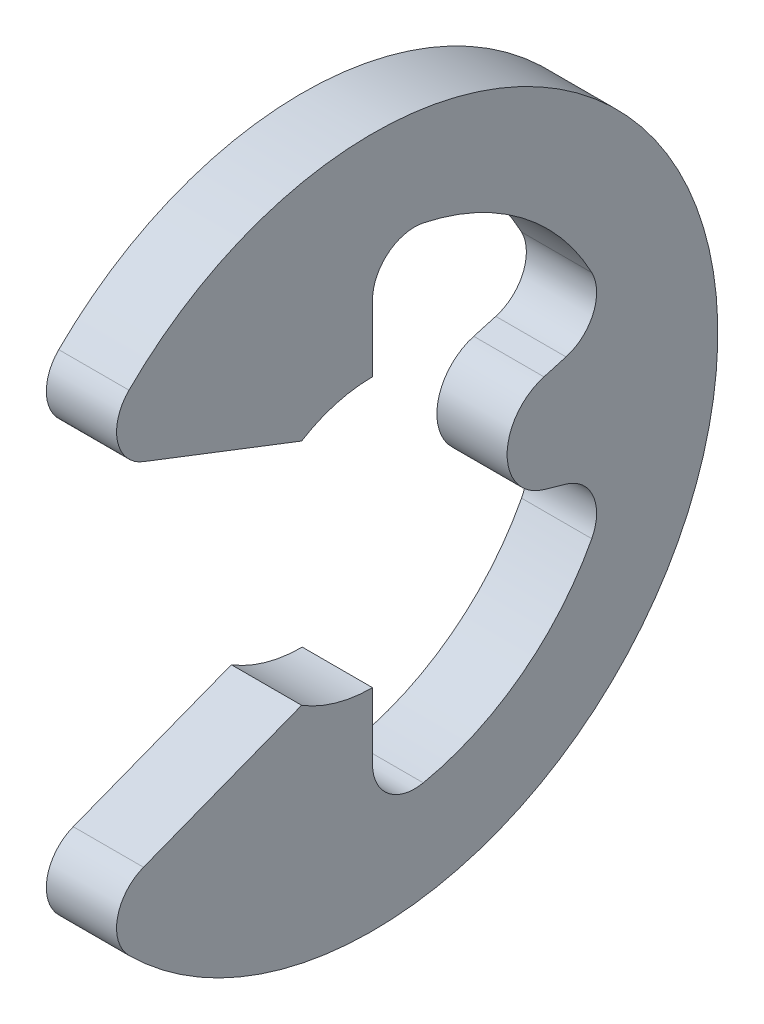
ISO-10303-21;
HEADER;
FILE_DESCRIPTION(('STEP AP214'),'2;1');
FILE_NAME('part.step','',(''),(''),'','','');
FILE_SCHEMA(('AUTOMOTIVE_DESIGN { 1 0 10303 214 1 1 1 1 }'));
ENDSEC;
DATA;
#1=APPLICATION_CONTEXT('core data for automotive mechanical design processes');
#2=APPLICATION_PROTOCOL_DEFINITION('international standard','automotive_design',2000,#1);
#3=PRODUCT_CONTEXT('',#1,'mechanical');
#4=PRODUCT('Part','Part','',(#3));
#5=PRODUCT_RELATED_PRODUCT_CATEGORY('part','',(#4));
#6=PRODUCT_DEFINITION_FORMATION('','',#4);
#7=PRODUCT_DEFINITION_CONTEXT('part definition',#1,'design');
#8=PRODUCT_DEFINITION('design','',#6,#7);
#9=PRODUCT_DEFINITION_SHAPE('','',#8);
#10=(LENGTH_UNIT() NAMED_UNIT(*) SI_UNIT(.MILLI.,.METRE.));
#11=(NAMED_UNIT(*) PLANE_ANGLE_UNIT() SI_UNIT($,.RADIAN.));
#12=(NAMED_UNIT(*) SI_UNIT($,.STERADIAN.) SOLID_ANGLE_UNIT());
#13=UNCERTAINTY_MEASURE_WITH_UNIT(LENGTH_MEASURE(1.E-05),#10,'distance_accuracy_value','');
#14=(GEOMETRIC_REPRESENTATION_CONTEXT(3) GLOBAL_UNCERTAINTY_ASSIGNED_CONTEXT((#13)) GLOBAL_UNIT_ASSIGNED_CONTEXT((#10,
#11,#12)) REPRESENTATION_CONTEXT('',''));
#15=CARTESIAN_POINT('',(0.,0.,0.));
#16=DIRECTION('',(0.,0.,1.));
#17=DIRECTION('',(1.,0.,0.));
#18=AXIS2_PLACEMENT_3D('',#15,#16,#17);
#19=CARTESIAN_POINT('',(0.3,0.,0.));
#20=DIRECTION('',(1.,0.,0.));
#21=DIRECTION('',(0.,0.,-1.));
#22=AXIS2_PLACEMENT_3D('',#19,#20,#21);
#23=PLANE('',#22);
#24=CARTESIAN_POINT('',(0.3,0.,-1.58371942763835));
#25=DIRECTION('',(1.,0.,0.));
#26=DIRECTION('',(0.,0.,-1.));
#27=AXIS2_PLACEMENT_3D('',#24,#25,#26);
#28=CIRCLE('',#27,0.433719427638346);
#29=CARTESIAN_POINT('',(0.3,0.417137988281592,-1.46494047056547));
#30=VERTEX_POINT('',#29);
#31=CARTESIAN_POINT('',(0.3,-0.417137988281593,-1.46494047056547));
#32=VERTEX_POINT('',#31);
#33=EDGE_CURVE('E192',#30,#32,#28,.T.);
#34=ORIENTED_EDGE('',*,*,#33,.T.);
#35=DIRECTION('',(0.,-0.273861278752584,-0.961769203083567));
#36=VECTOR('',#35,1.);
#37=CARTESIAN_POINT('',(0.3,-0.31494047056547,-1.1060345835461));
#38=LINE('',#37,#36);
#39=CARTESIAN_POINT('',(0.3,-0.470721986256722,-1.65312128701864));
#40=VERTEX_POINT('',#39);
#41=EDGE_CURVE('E93',#32,#40,#38,.T.);
#42=ORIENTED_EDGE('',*,*,#41,.T.);
#43=CARTESIAN_POINT('',(0.3,-0.816958899366806,-1.55453122666771));
#44=DIRECTION('',(1.,0.,0.));
#45=DIRECTION('',(0.,0.,-1.));
#46=AXIS2_PLACEMENT_3D('',#43,#44,#45);
#47=CIRCLE('',#46,0.36);
#48=CARTESIAN_POINT('',(0.3,-0.984432472418488,-1.87320441714552));
#49=VERTEX_POINT('',#48);
#50=EDGE_CURVE('E312',#40,#49,#47,.F.);
#51=ORIENTED_EDGE('',*,*,#50,.T.);
#52=CARTESIAN_POINT('',(0.3,0.,0.));
#53=DIRECTION('',(-1.,0.,0.));
#54=DIRECTION('',(0.,0.,-1.));
#55=AXIS2_PLACEMENT_3D('',#52,#53,#54);
#56=CIRCLE('',#55,2.11612903225807);
#57=CARTESIAN_POINT('',(0.3,-2.07118825523276,-0.433798677443055));
#58=VERTEX_POINT('',#57);
#59=EDGE_CURVE('E208',#49,#58,#56,.T.);
#60=ORIENTED_EDGE('',*,*,#59,.T.);
#61=CARTESIAN_POINT('',(0.3,-1.71883366790962,-0.359999999999999));
#62=DIRECTION('',(1.,0.,0.));
#63=DIRECTION('',(0.,0.,-1.));
#64=AXIS2_PLACEMENT_3D('',#61,#62,#63);
#65=CIRCLE('',#64,0.36);
#66=CARTESIAN_POINT('',(0.3,-1.71883366790962,0.));
#67=VERTEX_POINT('',#66);
#68=EDGE_CURVE('E303',#58,#67,#65,.F.);
#69=ORIENTED_EDGE('',*,*,#68,.T.);
#70=DIRECTION('',(0.,1.,0.));
#71=VECTOR('',#70,1.);
#72=CARTESIAN_POINT('',(0.3,-1.15,0.));
#73=LINE('',#72,#71);
#74=CARTESIAN_POINT('',(0.3,-1.15,0.));
#75=VERTEX_POINT('',#74);
#76=EDGE_CURVE('E211',#67,#75,#73,.T.);
#77=ORIENTED_EDGE('',*,*,#76,.T.);
#78=CARTESIAN_POINT('',(0.3,0.,0.));
#79=DIRECTION('',(-1.,0.,0.));
#80=DIRECTION('',(0.,0.,-1.));
#81=AXIS2_PLACEMENT_3D('',#78,#79,#80);
#82=CIRCLE('',#81,1.15);
#83=CARTESIAN_POINT('',(0.3,-0.977499999999999,0.605800090789033));
#84=VERTEX_POINT('',#83);
#85=EDGE_CURVE('E218',#75,#84,#82,.T.);
#86=ORIENTED_EDGE('',*,*,#85,.T.);
#87=DIRECTION('',(0.,-0.360953284628374,0.932583897735742));
#88=VECTOR('',#87,1.);
#89=CARTESIAN_POINT('',(0.3,-1.68124021687688,2.42403204045569));
#90=LINE('',#89,#88);
#91=CARTESIAN_POINT('',(0.3,-1.50034793710844,1.95666622188326));
#92=VERTEX_POINT('',#91);
#93=EDGE_CURVE('E220',#84,#92,#90,.T.);
#94=ORIENTED_EDGE('',*,*,#93,.T.);
#95=CARTESIAN_POINT('',(0.3,-1.83607814029331,1.82672303941705));
#96=DIRECTION('',(1.,0.,0.));
#97=DIRECTION('',(0.,0.,-1.));
#98=AXIS2_PLACEMENT_3D('',#95,#96,#97);
#99=CIRCLE('',#98,0.36);
#100=CARTESIAN_POINT('',(0.3,-2.09128591268929,2.08063048891131));
#101=VERTEX_POINT('',#100);
#102=EDGE_CURVE('E292',#92,#101,#99,.T.);
#103=ORIENTED_EDGE('',*,*,#102,.T.);
#104=CARTESIAN_POINT('',(0.3,0.,0.));
#105=DIRECTION('',(1.,0.,0.));
#106=DIRECTION('',(0.,0.,-1.));
#107=AXIS2_PLACEMENT_3D('',#104,#105,#106);
#108=CIRCLE('',#107,2.95);
#109=CARTESIAN_POINT('',(0.3,2.09128591268929,2.08063048891131));
#110=VERTEX_POINT('',#109);
#111=EDGE_CURVE('E252',#101,#110,#108,.T.);
#112=ORIENTED_EDGE('',*,*,#111,.T.);
#113=CARTESIAN_POINT('',(0.3,1.83607814029331,1.82672303941705));
#114=DIRECTION('',(1.,0.,0.));
#115=DIRECTION('',(0.,0.,-1.));
#116=AXIS2_PLACEMENT_3D('',#113,#114,#115);
#117=CIRCLE('',#116,0.36);
#118=CARTESIAN_POINT('',(0.3,1.50034793710844,1.95666622188326));
#119=VERTEX_POINT('',#118);
#120=EDGE_CURVE('E290',#110,#119,#117,.T.);
#121=ORIENTED_EDGE('',*,*,#120,.T.);
#122=DIRECTION('',(0.,-0.360953284628374,-0.932583897735742));
#123=VECTOR('',#122,1.);
#124=CARTESIAN_POINT('',(0.3,1.68124021687688,2.42403204045569));
#125=LINE('',#124,#123);
#126=CARTESIAN_POINT('',(0.3,0.977499999999999,0.605800090789033));
#127=VERTEX_POINT('',#126);
#128=EDGE_CURVE('E333',#119,#127,#125,.T.);
#129=ORIENTED_EDGE('',*,*,#128,.T.);
#130=CARTESIAN_POINT('',(0.3,0.,0.));
#131=DIRECTION('',(-1.,0.,0.));
#132=DIRECTION('',(0.,0.,1.));
#133=AXIS2_PLACEMENT_3D('',#130,#131,#132);
#134=CIRCLE('',#133,1.15);
#135=CARTESIAN_POINT('',(0.3,1.15,0.));
#136=VERTEX_POINT('',#135);
#137=EDGE_CURVE('E335',#127,#136,#134,.T.);
#138=ORIENTED_EDGE('',*,*,#137,.T.);
#139=DIRECTION('',(0.,1.,0.));
#140=VECTOR('',#139,1.);
#141=CARTESIAN_POINT('',(0.3,1.15,0.));
#142=LINE('',#141,#140);
#143=CARTESIAN_POINT('',(0.3,1.71883366790962,0.));
#144=VERTEX_POINT('',#143);
#145=EDGE_CURVE('E337',#136,#144,#142,.T.);
#146=ORIENTED_EDGE('',*,*,#145,.T.);
#147=CARTESIAN_POINT('',(0.3,1.71883366790962,-0.359999999999998));
#148=DIRECTION('',(1.,0.,0.));
#149=DIRECTION('',(0.,0.,-1.));
#150=AXIS2_PLACEMENT_3D('',#147,#148,#149);
#151=CIRCLE('',#150,0.36);
#152=CARTESIAN_POINT('',(0.3,2.07118825523276,-0.433798677443054));
#153=VERTEX_POINT('',#152);
#154=EDGE_CURVE('E307',#144,#153,#151,.F.);
#155=ORIENTED_EDGE('',*,*,#154,.T.);
#156=CARTESIAN_POINT('',(0.3,0.,0.));
#157=DIRECTION('',(-1.,0.,0.));
#158=DIRECTION('',(0.,0.,-1.));
#159=AXIS2_PLACEMENT_3D('',#156,#157,#158);
#160=CIRCLE('',#159,2.11612903225807);
#161=CARTESIAN_POINT('',(0.3,0.984432472418488,-1.87320441714552));
#162=VERTEX_POINT('',#161);
#163=EDGE_CURVE('E213',#153,#162,#160,.T.);
#164=ORIENTED_EDGE('',*,*,#163,.T.);
#165=CARTESIAN_POINT('',(0.3,0.816958899366807,-1.55453122666771));
#166=DIRECTION('',(1.,0.,0.));
#167=DIRECTION('',(0.,0.,-1.));
#168=AXIS2_PLACEMENT_3D('',#165,#166,#167);
#169=CIRCLE('',#168,0.36);
#170=CARTESIAN_POINT('',(0.3,0.470721986256722,-1.65312128701864));
#171=VERTEX_POINT('',#170);
#172=EDGE_CURVE('E12',#162,#171,#169,.F.);
#173=ORIENTED_EDGE('',*,*,#172,.T.);
#174=DIRECTION('',(0.,-0.273861278752584,0.961769203083567));
#175=VECTOR('',#174,1.);
#176=CARTESIAN_POINT('',(0.3,0.31494047056547,-1.1060345835461));
#177=LINE('',#176,#175);
#178=EDGE_CURVE('E195',#171,#30,#177,.T.);
#179=ORIENTED_EDGE('',*,*,#178,.T.);
#180=EDGE_LOOP('',(#34,#42,#51,#60,#69,#77,#86,#94,#103,#112,#121,#129,#138,#146,#155,#164,#173,#179));
#181=FACE_BOUND('',#180,.T.);
#182=ADVANCED_FACE('F70',(#181),#23,.T.);
#183=CARTESIAN_POINT('',(-0.3,0.,0.));
#184=DIRECTION('',(1.,0.,0.));
#185=DIRECTION('',(0.,0.,-1.));
#186=AXIS2_PLACEMENT_3D('',#183,#184,#185);
#187=PLANE('',#186);
#188=DIRECTION('',(0.,-0.273861278752584,-0.961769203083567));
#189=VECTOR('',#188,1.);
#190=CARTESIAN_POINT('',(-0.3,-0.31494047056547,-1.1060345835461));
#191=LINE('',#190,#189);
#192=CARTESIAN_POINT('',(-0.3,-0.417137988281593,-1.46494047056547));
#193=VERTEX_POINT('',#192);
#194=CARTESIAN_POINT('',(-0.3,-0.470721986256722,-1.65312128701864));
#195=VERTEX_POINT('',#194);
#196=EDGE_CURVE('E240',#193,#195,#191,.T.);
#197=ORIENTED_EDGE('',*,*,#196,.F.);
#198=CARTESIAN_POINT('',(-0.3,0.,-1.58371942763835));
#199=DIRECTION('',(1.,0.,0.));
#200=DIRECTION('',(0.,0.,-1.));
#201=AXIS2_PLACEMENT_3D('',#198,#199,#200);
#202=CIRCLE('',#201,0.433719427638346);
#203=CARTESIAN_POINT('',(-0.3,0.417137988281593,-1.46494047056547));
#204=VERTEX_POINT('',#203);
#205=EDGE_CURVE('E196',#204,#193,#202,.T.);
#206=ORIENTED_EDGE('',*,*,#205,.F.);
#207=DIRECTION('',(0.,-0.273861278752584,0.961769203083567));
#208=VECTOR('',#207,1.);
#209=CARTESIAN_POINT('',(-0.3,0.31494047056547,-1.1060345835461));
#210=LINE('',#209,#208);
#211=CARTESIAN_POINT('',(-0.3,0.470721986256722,-1.65312128701864));
#212=VERTEX_POINT('',#211);
#213=EDGE_CURVE('E237',#212,#204,#210,.T.);
#214=ORIENTED_EDGE('',*,*,#213,.F.);
#215=CARTESIAN_POINT('',(-0.3,0.816958899366807,-1.55453122666771));
#216=DIRECTION('',(1.,0.,0.));
#217=DIRECTION('',(0.,0.,-1.));
#218=AXIS2_PLACEMENT_3D('',#215,#216,#217);
#219=CIRCLE('',#218,0.36);
#220=CARTESIAN_POINT('',(-0.3,0.984432472418488,-1.87320441714552));
#221=VERTEX_POINT('',#220);
#222=EDGE_CURVE('E78',#212,#221,#219,.T.);
#223=ORIENTED_EDGE('',*,*,#222,.T.);
#224=CARTESIAN_POINT('',(-0.3,0.,0.));
#225=DIRECTION('',(-1.,0.,0.));
#226=DIRECTION('',(0.,0.,-1.));
#227=AXIS2_PLACEMENT_3D('',#224,#225,#226);
#228=CIRCLE('',#227,2.11612903225807);
#229=CARTESIAN_POINT('',(-0.3,2.07118825523276,-0.433798677443054));
#230=VERTEX_POINT('',#229);
#231=EDGE_CURVE('E234',#230,#221,#228,.T.);
#232=ORIENTED_EDGE('',*,*,#231,.F.);
#233=CARTESIAN_POINT('',(-0.3,1.71883366790962,-0.359999999999998));
#234=DIRECTION('',(1.,0.,0.));
#235=DIRECTION('',(0.,0.,-1.));
#236=AXIS2_PLACEMENT_3D('',#233,#234,#235);
#237=CIRCLE('',#236,0.36);
#238=CARTESIAN_POINT('',(-0.3,1.71883366790962,0.));
#239=VERTEX_POINT('',#238);
#240=EDGE_CURVE('E305',#230,#239,#237,.T.);
#241=ORIENTED_EDGE('',*,*,#240,.T.);
#242=DIRECTION('',(0.,1.,0.));
#243=VECTOR('',#242,1.);
#244=CARTESIAN_POINT('',(-0.3,1.15,0.));
#245=LINE('',#244,#243);
#246=CARTESIAN_POINT('',(-0.3,1.15,0.));
#247=VERTEX_POINT('',#246);
#248=EDGE_CURVE('E231',#247,#239,#245,.T.);
#249=ORIENTED_EDGE('',*,*,#248,.F.);
#250=CARTESIAN_POINT('',(-0.3,0.,0.));
#251=DIRECTION('',(-1.,0.,0.));
#252=DIRECTION('',(0.,0.,1.));
#253=AXIS2_PLACEMENT_3D('',#250,#251,#252);
#254=CIRCLE('',#253,1.15);
#255=CARTESIAN_POINT('',(-0.3,0.977499999999999,0.605800090789033));
#256=VERTEX_POINT('',#255);
#257=EDGE_CURVE('E229',#256,#247,#254,.T.);
#258=ORIENTED_EDGE('',*,*,#257,.F.);
#259=DIRECTION('',(0.,-0.360953284628374,-0.932583897735742));
#260=VECTOR('',#259,1.);
#261=CARTESIAN_POINT('',(-0.3,1.68124021687688,2.42403204045569));
#262=LINE('',#261,#260);
#263=CARTESIAN_POINT('',(-0.3,1.50034793710844,1.95666622188326));
#264=VERTEX_POINT('',#263);
#265=EDGE_CURVE('E227',#264,#256,#262,.T.);
#266=ORIENTED_EDGE('',*,*,#265,.F.);
#267=CARTESIAN_POINT('',(-0.3,1.83607814029331,1.82672303941705));
#268=DIRECTION('',(1.,0.,0.));
#269=DIRECTION('',(0.,0.,-1.));
#270=AXIS2_PLACEMENT_3D('',#267,#268,#269);
#271=CIRCLE('',#270,0.36);
#272=CARTESIAN_POINT('',(-0.3,2.09128591268929,2.08063048891131));
#273=VERTEX_POINT('',#272);
#274=EDGE_CURVE('E284',#264,#273,#271,.F.);
#275=ORIENTED_EDGE('',*,*,#274,.T.);
#276=CARTESIAN_POINT('',(-0.3,0.,0.));
#277=DIRECTION('',(1.,0.,0.));
#278=DIRECTION('',(0.,0.,-1.));
#279=AXIS2_PLACEMENT_3D('',#276,#277,#278);
#280=CIRCLE('',#279,2.95);
#281=CARTESIAN_POINT('',(-0.3,-2.09128591268929,2.08063048891131));
#282=VERTEX_POINT('',#281);
#283=EDGE_CURVE('E224',#282,#273,#280,.T.);
#284=ORIENTED_EDGE('',*,*,#283,.F.);
#285=CARTESIAN_POINT('',(-0.3,-1.83607814029331,1.82672303941705));
#286=DIRECTION('',(1.,0.,0.));
#287=DIRECTION('',(0.,0.,-1.));
#288=AXIS2_PLACEMENT_3D('',#285,#286,#287);
#289=CIRCLE('',#288,0.36);
#290=CARTESIAN_POINT('',(-0.3,-1.50034793710844,1.95666622188326));
#291=VERTEX_POINT('',#290);
#292=EDGE_CURVE('E286',#282,#291,#289,.F.);
#293=ORIENTED_EDGE('',*,*,#292,.T.);
#294=DIRECTION('',(0.,-0.360953284628374,0.932583897735742));
#295=VECTOR('',#294,1.);
#296=CARTESIAN_POINT('',(-0.3,-1.68124021687688,2.42403204045569));
#297=LINE('',#296,#295);
#298=CARTESIAN_POINT('',(-0.3,-0.977499999999999,0.605800090789033));
#299=VERTEX_POINT('',#298);
#300=EDGE_CURVE('E249',#299,#291,#297,.T.);
#301=ORIENTED_EDGE('',*,*,#300,.F.);
#302=CARTESIAN_POINT('',(-0.3,0.,0.));
#303=DIRECTION('',(-1.,0.,0.));
#304=DIRECTION('',(0.,0.,-1.));
#305=AXIS2_PLACEMENT_3D('',#302,#303,#304);
#306=CIRCLE('',#305,1.15);
#307=CARTESIAN_POINT('',(-0.3,-1.15,0.));
#308=VERTEX_POINT('',#307);
#309=EDGE_CURVE('E247',#308,#299,#306,.T.);
#310=ORIENTED_EDGE('',*,*,#309,.F.);
#311=DIRECTION('',(0.,1.,0.));
#312=VECTOR('',#311,1.);
#313=CARTESIAN_POINT('',(-0.3,-1.15,0.));
#314=LINE('',#313,#312);
#315=CARTESIAN_POINT('',(-0.3,-1.71883366790962,0.));
#316=VERTEX_POINT('',#315);
#317=EDGE_CURVE('E245',#316,#308,#314,.T.);
#318=ORIENTED_EDGE('',*,*,#317,.F.);
#319=CARTESIAN_POINT('',(-0.3,-1.71883366790962,-0.359999999999999));
#320=DIRECTION('',(1.,0.,0.));
#321=DIRECTION('',(0.,0.,-1.));
#322=AXIS2_PLACEMENT_3D('',#319,#320,#321);
#323=CIRCLE('',#322,0.36);
#324=CARTESIAN_POINT('',(-0.3,-2.07118825523276,-0.433798677443055));
#325=VERTEX_POINT('',#324);
#326=EDGE_CURVE('E301',#316,#325,#323,.T.);
#327=ORIENTED_EDGE('',*,*,#326,.T.);
#328=CARTESIAN_POINT('',(-0.3,0.,0.));
#329=DIRECTION('',(-1.,0.,0.));
#330=DIRECTION('',(0.,0.,-1.));
#331=AXIS2_PLACEMENT_3D('',#328,#329,#330);
#332=CIRCLE('',#331,2.11612903225807);
#333=CARTESIAN_POINT('',(-0.3,-0.984432472418488,-1.87320441714552));
#334=VERTEX_POINT('',#333);
#335=EDGE_CURVE('E242',#334,#325,#332,.T.);
#336=ORIENTED_EDGE('',*,*,#335,.F.);
#337=CARTESIAN_POINT('',(-0.3,-0.816958899366806,-1.55453122666771));
#338=DIRECTION('',(1.,0.,0.));
#339=DIRECTION('',(0.,0.,-1.));
#340=AXIS2_PLACEMENT_3D('',#337,#338,#339);
#341=CIRCLE('',#340,0.36);
#342=EDGE_CURVE('E309',#334,#195,#341,.T.);
#343=ORIENTED_EDGE('',*,*,#342,.T.);
#344=EDGE_LOOP('',(#197,#206,#214,#223,#232,#241,#249,#258,#266,#275,#284,#293,#301,#310,#318,
#327,#336,#343));
#345=FACE_BOUND('',#344,.T.);
#346=ADVANCED_FACE('F316',(#345),#187,.F.);
#347=CARTESIAN_POINT('',(0.3,-0.31494047056547,-1.1060345835461));
#348=DIRECTION('',(0.,0.961769203083567,-0.273861278752584));
#349=DIRECTION('',(0.,0.273861278752584,0.961769203083567));
#350=AXIS2_PLACEMENT_3D('',#347,#348,#349);
#351=PLANE('',#350);
#352=DIRECTION('',(1.,0.,0.));
#353=VECTOR('',#352,1.);
#354=CARTESIAN_POINT('',(-0.3,-0.417137988281593,-1.46494047056547));
#355=LINE('',#354,#353);
#356=EDGE_CURVE('E197',#193,#32,#355,.T.);
#357=ORIENTED_EDGE('',*,*,#356,.F.);
#358=ORIENTED_EDGE('',*,*,#196,.T.);
#359=DIRECTION('',(1.,0.,0.));
#360=VECTOR('',#359,1.);
#361=CARTESIAN_POINT('',(0.3,-0.470721986256722,-1.65312128701864));
#362=LINE('',#361,#360);
#363=EDGE_CURVE('E206',#195,#40,#362,.T.);
#364=ORIENTED_EDGE('',*,*,#363,.T.);
#365=ORIENTED_EDGE('',*,*,#41,.F.);
#366=EDGE_LOOP('',(#357,#358,#364,#365));
#367=FACE_BOUND('',#366,.T.);
#368=ADVANCED_FACE('F204',(#367),#351,.F.);
#369=CARTESIAN_POINT('',(0.3,0.,0.));
#370=DIRECTION('',(-1.,0.,0.));
#371=DIRECTION('',(0.,0.,1.));
#372=AXIS2_PLACEMENT_3D('',#369,#370,#371);
#373=CYLINDRICAL_SURFACE('',#372,2.95);
#374=ORIENTED_EDGE('',*,*,#111,.F.);
#375=DIRECTION('',(-1.,0.,0.));
#376=VECTOR('',#375,1.);
#377=CARTESIAN_POINT('',(0.3,-2.09128591268929,2.08063048891131));
#378=LINE('',#377,#376);
#379=EDGE_CURVE('E281',#101,#282,#378,.T.);
#380=ORIENTED_EDGE('',*,*,#379,.T.);
#381=ORIENTED_EDGE('',*,*,#283,.T.);
#382=DIRECTION('',(-1.,0.,0.));
#383=VECTOR('',#382,1.);
#384=CARTESIAN_POINT('',(0.3,2.09128591268929,2.08063048891131));
#385=LINE('',#384,#383);
#386=EDGE_CURVE('E279',#273,#110,#385,.F.);
#387=ORIENTED_EDGE('',*,*,#386,.T.);
#388=EDGE_LOOP('',(#374,#380,#381,#387));
#389=FACE_BOUND('',#388,.T.);
#390=ADVANCED_FACE('F365',(#389),#373,.T.);
#391=CARTESIAN_POINT('',(0.3,1.68124021687688,2.42403204045569));
#392=DIRECTION('',(0.,0.932583897735741,-0.360953284628374));
#393=DIRECTION('',(0.,0.360953284628374,0.932583897735741));
#394=AXIS2_PLACEMENT_3D('',#391,#392,#393);
#395=PLANE('',#394);
#396=ORIENTED_EDGE('',*,*,#128,.F.);
#397=DIRECTION('',(-1.,0.,0.));
#398=VECTOR('',#397,1.);
#399=CARTESIAN_POINT('',(0.3,1.50034793710844,1.95666622188326));
#400=LINE('',#399,#398);
#401=EDGE_CURVE('E294',#119,#264,#400,.T.);
#402=ORIENTED_EDGE('',*,*,#401,.T.);
#403=ORIENTED_EDGE('',*,*,#265,.T.);
#404=DIRECTION('',(-1.,0.,0.));
#405=VECTOR('',#404,1.);
#406=CARTESIAN_POINT('',(0.3,0.977499999999999,0.605800090789033));
#407=LINE('',#406,#405);
#408=EDGE_CURVE('E261',#127,#256,#407,.T.);
#409=ORIENTED_EDGE('',*,*,#408,.F.);
#410=EDGE_LOOP('',(#396,#402,#403,#409));
#411=FACE_BOUND('',#410,.T.);
#412=ADVANCED_FACE('F357',(#411),#395,.F.);
#413=CARTESIAN_POINT('',(0.3,0.,0.));
#414=DIRECTION('',(-1.,0.,0.));
#415=DIRECTION('',(0.,0.,1.));
#416=AXIS2_PLACEMENT_3D('',#413,#414,#415);
#417=CYLINDRICAL_SURFACE('',#416,1.15);
#418=ORIENTED_EDGE('',*,*,#257,.T.);
#419=DIRECTION('',(-1.,0.,0.));
#420=VECTOR('',#419,1.);
#421=CARTESIAN_POINT('',(0.3,1.15,0.));
#422=LINE('',#421,#420);
#423=EDGE_CURVE('E258',#136,#247,#422,.T.);
#424=ORIENTED_EDGE('',*,*,#423,.F.);
#425=ORIENTED_EDGE('',*,*,#137,.F.);
#426=ORIENTED_EDGE('',*,*,#408,.T.);
#427=EDGE_LOOP('',(#418,#424,#425,#426));
#428=FACE_BOUND('',#427,.T.);
#429=ADVANCED_FACE('F351',(#428),#417,.F.);
#430=CARTESIAN_POINT('',(0.3,1.15,0.));
#431=DIRECTION('',(0.,0.,1.));
#432=DIRECTION('',(0.,-1.,0.));
#433=AXIS2_PLACEMENT_3D('',#430,#431,#432);
#434=PLANE('',#433);
#435=ORIENTED_EDGE('',*,*,#248,.T.);
#436=DIRECTION('',(1.,0.,0.));
#437=VECTOR('',#436,1.);
#438=CARTESIAN_POINT('',(0.3,1.71883366790962,0.));
#439=LINE('',#438,#437);
#440=EDGE_CURVE('E277',#239,#144,#439,.T.);
#441=ORIENTED_EDGE('',*,*,#440,.T.);
#442=ORIENTED_EDGE('',*,*,#145,.F.);
#443=ORIENTED_EDGE('',*,*,#423,.T.);
#444=EDGE_LOOP('',(#435,#441,#442,#443));
#445=FACE_BOUND('',#444,.T.);
#446=ADVANCED_FACE('F349',(#445),#434,.F.);
#447=CARTESIAN_POINT('',(0.3,0.,0.));
#448=DIRECTION('',(-1.,0.,0.));
#449=DIRECTION('',(0.,0.,1.));
#450=AXIS2_PLACEMENT_3D('',#447,#448,#449);
#451=CYLINDRICAL_SURFACE('',#450,2.11612903225807);
#452=ORIENTED_EDGE('',*,*,#163,.F.);
#453=DIRECTION('',(-1.,0.,0.));
#454=VECTOR('',#453,1.);
#455=CARTESIAN_POINT('',(0.3,2.07118825523276,-0.433798677443055));
#456=LINE('',#455,#454);
#457=EDGE_CURVE('E274',#153,#230,#456,.T.);
#458=ORIENTED_EDGE('',*,*,#457,.T.);
#459=ORIENTED_EDGE('',*,*,#231,.T.);
#460=DIRECTION('',(-1.,0.,0.));
#461=VECTOR('',#460,1.);
#462=CARTESIAN_POINT('',(0.3,0.984432472418488,-1.87320441714552));
#463=LINE('',#462,#461);
#464=EDGE_CURVE('E272',#221,#162,#463,.F.);
#465=ORIENTED_EDGE('',*,*,#464,.T.);
#466=EDGE_LOOP('',(#452,#458,#459,#465));
#467=FACE_BOUND('',#466,.T.);
#468=ADVANCED_FACE('F322',(#467),#451,.F.);
#469=CARTESIAN_POINT('',(0.3,0.31494047056547,-1.1060345835461));
#470=DIRECTION('',(0.,-0.961769203083567,-0.273861278752584));
#471=DIRECTION('',(0.,0.273861278752584,-0.961769203083567));
#472=AXIS2_PLACEMENT_3D('',#469,#470,#471);
#473=PLANE('',#472);
#474=ORIENTED_EDGE('',*,*,#213,.T.);
#475=DIRECTION('',(1.,0.,0.));
#476=VECTOR('',#475,1.);
#477=CARTESIAN_POINT('',(-0.3,0.417137988281592,-1.46494047056547));
#478=LINE('',#477,#476);
#479=EDGE_CURVE('E85',#204,#30,#478,.T.);
#480=ORIENTED_EDGE('',*,*,#479,.T.);
#481=ORIENTED_EDGE('',*,*,#178,.F.);
#482=DIRECTION('',(1.,0.,0.));
#483=VECTOR('',#482,1.);
#484=CARTESIAN_POINT('',(-0.3,0.470721986256722,-1.65312128701864));
#485=LINE('',#484,#483);
#486=EDGE_CURVE('E298',#171,#212,#485,.F.);
#487=ORIENTED_EDGE('',*,*,#486,.T.);
#488=EDGE_LOOP('',(#474,#480,#481,#487));
#489=FACE_BOUND('',#488,.T.);
#490=ADVANCED_FACE('F327',(#489),#473,.F.);
#491=CARTESIAN_POINT('',(0.3,0.,0.));
#492=DIRECTION('',(-1.,0.,0.));
#493=DIRECTION('',(0.,0.,1.));
#494=AXIS2_PLACEMENT_3D('',#491,#492,#493);
#495=CYLINDRICAL_SURFACE('',#494,2.11612903225807);
#496=ORIENTED_EDGE('',*,*,#335,.T.);
#497=DIRECTION('',(-1.,0.,0.));
#498=VECTOR('',#497,1.);
#499=CARTESIAN_POINT('',(0.3,-2.07118825523276,-0.433798677443055));
#500=LINE('',#499,#498);
#501=EDGE_CURVE('E270',#325,#58,#500,.F.);
#502=ORIENTED_EDGE('',*,*,#501,.T.);
#503=ORIENTED_EDGE('',*,*,#59,.F.);
#504=DIRECTION('',(-1.,0.,0.));
#505=VECTOR('',#504,1.);
#506=CARTESIAN_POINT('',(0.3,-0.984432472418488,-1.87320441714552));
#507=LINE('',#506,#505);
#508=EDGE_CURVE('E267',#49,#334,#507,.T.);
#509=ORIENTED_EDGE('',*,*,#508,.T.);
#510=EDGE_LOOP('',(#496,#502,#503,#509));
#511=FACE_BOUND('',#510,.T.);
#512=ADVANCED_FACE('F393',(#511),#495,.F.);
#513=CARTESIAN_POINT('',(0.3,-1.15,0.));
#514=DIRECTION('',(0.,0.,1.));
#515=DIRECTION('',(0.,-1.,0.));
#516=AXIS2_PLACEMENT_3D('',#513,#514,#515);
#517=PLANE('',#516);
#518=ORIENTED_EDGE('',*,*,#76,.F.);
#519=DIRECTION('',(1.,0.,0.));
#520=VECTOR('',#519,1.);
#521=CARTESIAN_POINT('',(-0.3,-1.71883366790962,0.));
#522=LINE('',#521,#520);
#523=EDGE_CURVE('E264',#67,#316,#522,.F.);
#524=ORIENTED_EDGE('',*,*,#523,.T.);
#525=ORIENTED_EDGE('',*,*,#317,.T.);
#526=DIRECTION('',(-1.,0.,0.));
#527=VECTOR('',#526,1.);
#528=CARTESIAN_POINT('',(0.3,-1.15,0.));
#529=LINE('',#528,#527);
#530=EDGE_CURVE('E255',#75,#308,#529,.T.);
#531=ORIENTED_EDGE('',*,*,#530,.F.);
#532=EDGE_LOOP('',(#518,#524,#525,#531));
#533=FACE_BOUND('',#532,.T.);
#534=ADVANCED_FACE('F385',(#533),#517,.F.);
#535=CARTESIAN_POINT('',(0.3,0.,0.));
#536=DIRECTION('',(-1.,0.,0.));
#537=DIRECTION('',(0.,0.,1.));
#538=AXIS2_PLACEMENT_3D('',#535,#536,#537);
#539=CYLINDRICAL_SURFACE('',#538,1.15);
#540=ORIENTED_EDGE('',*,*,#309,.T.);
#541=DIRECTION('',(-1.,0.,0.));
#542=VECTOR('',#541,1.);
#543=CARTESIAN_POINT('',(0.3,-0.977499999999999,0.605800090789033));
#544=LINE('',#543,#542);
#545=EDGE_CURVE('E223',#84,#299,#544,.T.);
#546=ORIENTED_EDGE('',*,*,#545,.F.);
#547=ORIENTED_EDGE('',*,*,#85,.F.);
#548=ORIENTED_EDGE('',*,*,#530,.T.);
#549=EDGE_LOOP('',(#540,#546,#547,#548));
#550=FACE_BOUND('',#549,.T.);
#551=ADVANCED_FACE('F379',(#550),#539,.F.);
#552=CARTESIAN_POINT('',(0.3,-1.68124021687688,2.42403204045569));
#553=DIRECTION('',(0.,-0.932583897735741,-0.360953284628374));
#554=DIRECTION('',(0.,0.360953284628374,-0.932583897735741));
#555=AXIS2_PLACEMENT_3D('',#552,#553,#554);
#556=PLANE('',#555);
#557=ORIENTED_EDGE('',*,*,#300,.T.);
#558=DIRECTION('',(-1.,0.,0.));
#559=VECTOR('',#558,1.);
#560=CARTESIAN_POINT('',(0.3,-1.50034793710844,1.95666622188326));
#561=LINE('',#560,#559);
#562=EDGE_CURVE('E288',#291,#92,#561,.F.);
#563=ORIENTED_EDGE('',*,*,#562,.T.);
#564=ORIENTED_EDGE('',*,*,#93,.F.);
#565=ORIENTED_EDGE('',*,*,#545,.T.);
#566=EDGE_LOOP('',(#557,#563,#564,#565));
#567=FACE_BOUND('',#566,.T.);
#568=ADVANCED_FACE('F375',(#567),#556,.F.);
#569=CARTESIAN_POINT('',(0.3,-1.71883366790962,-0.359999999999999));
#570=DIRECTION('',(-1.,0.,0.));
#571=DIRECTION('',(0.,0.,1.));
#572=AXIS2_PLACEMENT_3D('',#569,#570,#571);
#573=CYLINDRICAL_SURFACE('',#572,0.36);
#574=ORIENTED_EDGE('',*,*,#68,.F.);
#575=ORIENTED_EDGE('',*,*,#501,.F.);
#576=ORIENTED_EDGE('',*,*,#326,.F.);
#577=ORIENTED_EDGE('',*,*,#523,.F.);
#578=EDGE_LOOP('',(#574,#575,#576,#577));
#579=FACE_BOUND('',#578,.T.);
#580=ADVANCED_FACE('F389',(#579),#573,.F.);
#581=CARTESIAN_POINT('',(0.3,1.71883366790962,-0.359999999999998));
#582=DIRECTION('',(-1.,0.,0.));
#583=DIRECTION('',(0.,0.,1.));
#584=AXIS2_PLACEMENT_3D('',#581,#582,#583);
#585=CYLINDRICAL_SURFACE('',#584,0.36);
#586=ORIENTED_EDGE('',*,*,#154,.F.);
#587=ORIENTED_EDGE('',*,*,#440,.F.);
#588=ORIENTED_EDGE('',*,*,#240,.F.);
#589=ORIENTED_EDGE('',*,*,#457,.F.);
#590=EDGE_LOOP('',(#586,#587,#588,#589));
#591=FACE_BOUND('',#590,.T.);
#592=ADVANCED_FACE('F346',(#591),#585,.F.);
#593=CARTESIAN_POINT('',(0.3,-1.83607814029331,1.82672303941705));
#594=DIRECTION('',(-1.,0.,0.));
#595=DIRECTION('',(0.,0.,1.));
#596=AXIS2_PLACEMENT_3D('',#593,#594,#595);
#597=CYLINDRICAL_SURFACE('',#596,0.36);
#598=ORIENTED_EDGE('',*,*,#102,.F.);
#599=ORIENTED_EDGE('',*,*,#562,.F.);
#600=ORIENTED_EDGE('',*,*,#292,.F.);
#601=ORIENTED_EDGE('',*,*,#379,.F.);
#602=EDGE_LOOP('',(#598,#599,#600,#601));
#603=FACE_BOUND('',#602,.T.);
#604=ADVANCED_FACE('F371',(#603),#597,.T.);
#605=CARTESIAN_POINT('',(0.3,1.83607814029331,1.82672303941705));
#606=DIRECTION('',(-1.,0.,0.));
#607=DIRECTION('',(0.,0.,1.));
#608=AXIS2_PLACEMENT_3D('',#605,#606,#607);
#609=CYLINDRICAL_SURFACE('',#608,0.36);
#610=ORIENTED_EDGE('',*,*,#120,.F.);
#611=ORIENTED_EDGE('',*,*,#386,.F.);
#612=ORIENTED_EDGE('',*,*,#274,.F.);
#613=ORIENTED_EDGE('',*,*,#401,.F.);
#614=EDGE_LOOP('',(#610,#611,#612,#613));
#615=FACE_BOUND('',#614,.T.);
#616=ADVANCED_FACE('F361',(#615),#609,.T.);
#617=CARTESIAN_POINT('',(0.3,-0.816958899366806,-1.55453122666771));
#618=DIRECTION('',(-1.,0.,0.));
#619=DIRECTION('',(0.,0.,1.));
#620=AXIS2_PLACEMENT_3D('',#617,#618,#619);
#621=CYLINDRICAL_SURFACE('',#620,0.36);
#622=ORIENTED_EDGE('',*,*,#50,.F.);
#623=ORIENTED_EDGE('',*,*,#363,.F.);
#624=ORIENTED_EDGE('',*,*,#342,.F.);
#625=ORIENTED_EDGE('',*,*,#508,.F.);
#626=EDGE_LOOP('',(#622,#623,#624,#625));
#627=FACE_BOUND('',#626,.T.);
#628=ADVANCED_FACE('F396',(#627),#621,.F.);
#629=CARTESIAN_POINT('',(0.3,0.816958899366807,-1.55453122666771));
#630=DIRECTION('',(-1.,0.,0.));
#631=DIRECTION('',(0.,0.,1.));
#632=AXIS2_PLACEMENT_3D('',#629,#630,#631);
#633=CYLINDRICAL_SURFACE('',#632,0.36);
#634=ORIENTED_EDGE('',*,*,#172,.F.);
#635=ORIENTED_EDGE('',*,*,#464,.F.);
#636=ORIENTED_EDGE('',*,*,#222,.F.);
#637=ORIENTED_EDGE('',*,*,#486,.F.);
#638=EDGE_LOOP('',(#634,#635,#636,#637));
#639=FACE_BOUND('',#638,.T.);
#640=ADVANCED_FACE('F72',(#639),#633,.F.);
#641=CARTESIAN_POINT('',(-0.3,0.,-1.58371942763835));
#642=DIRECTION('',(1.,0.,0.));
#643=DIRECTION('',(0.,0.,-1.));
#644=AXIS2_PLACEMENT_3D('',#641,#642,#643);
#645=CYLINDRICAL_SURFACE('',#644,0.433719427638346);
#646=ORIENTED_EDGE('',*,*,#479,.F.);
#647=ORIENTED_EDGE('',*,*,#205,.T.);
#648=ORIENTED_EDGE('',*,*,#356,.T.);
#649=ORIENTED_EDGE('',*,*,#33,.F.);
#650=EDGE_LOOP('',(#646,#647,#648,#649));
#651=FACE_BOUND('',#650,.T.);
#652=ADVANCED_FACE('F200',(#651),#645,.T.);
#653=CLOSED_SHELL('',(#182,#346,#368,#390,#412,#429,#446,#468,#490,#512,#534,#551,#568,#580,
#592,#604,#616,#628,#640,#652));
#654=MANIFOLD_SOLID_BREP('B2',#653);
#655=ADVANCED_BREP_SHAPE_REPRESENTATION('',(#18,#654),#14);
#656=SHAPE_DEFINITION_REPRESENTATION(#9,#655);
ENDSEC;
END-ISO-10303-21;
